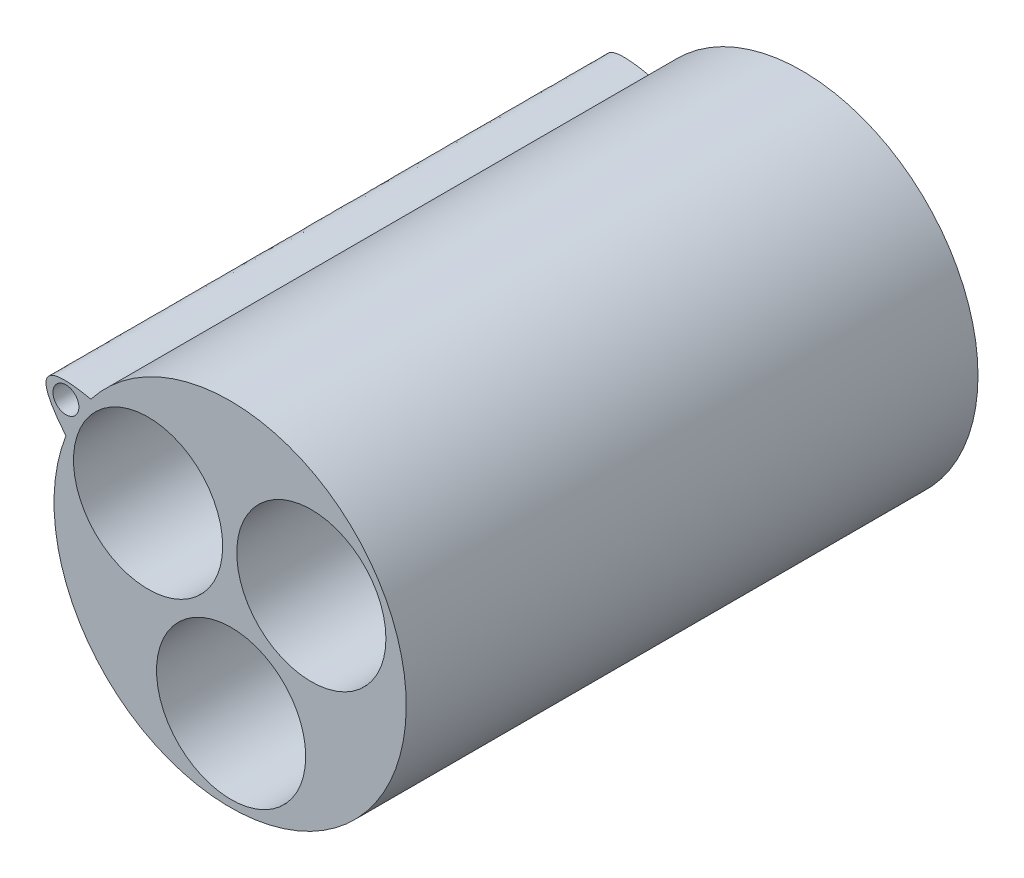
ISO-10303-21;
HEADER;
FILE_DESCRIPTION(('STEP AP214'),'2;1');
FILE_NAME('part.step','',(''),(''),'','','');
FILE_SCHEMA(('AUTOMOTIVE_DESIGN { 1 0 10303 214 1 1 1 1 }'));
ENDSEC;
DATA;
#1=APPLICATION_CONTEXT('core data for automotive mechanical design processes');
#2=APPLICATION_PROTOCOL_DEFINITION('international standard','automotive_design',2000,#1);
#3=PRODUCT_CONTEXT('',#1,'mechanical');
#4=PRODUCT('Part','Part','',(#3));
#5=PRODUCT_RELATED_PRODUCT_CATEGORY('part','',(#4));
#6=PRODUCT_DEFINITION_FORMATION('','',#4);
#7=PRODUCT_DEFINITION_CONTEXT('part definition',#1,'design');
#8=PRODUCT_DEFINITION('design','',#6,#7);
#9=PRODUCT_DEFINITION_SHAPE('','',#8);
#10=(LENGTH_UNIT() NAMED_UNIT(*) SI_UNIT(.MILLI.,.METRE.));
#11=(NAMED_UNIT(*) PLANE_ANGLE_UNIT() SI_UNIT($,.RADIAN.));
#12=(NAMED_UNIT(*) SI_UNIT($,.STERADIAN.) SOLID_ANGLE_UNIT());
#13=UNCERTAINTY_MEASURE_WITH_UNIT(LENGTH_MEASURE(1.E-05),#10,'distance_accuracy_value','');
#14=(GEOMETRIC_REPRESENTATION_CONTEXT(3) GLOBAL_UNCERTAINTY_ASSIGNED_CONTEXT((#13)) GLOBAL_UNIT_ASSIGNED_CONTEXT((#10,
#11,#12)) REPRESENTATION_CONTEXT('',''));
#15=CARTESIAN_POINT('',(0.,0.,0.));
#16=DIRECTION('',(0.,0.,1.));
#17=DIRECTION('',(1.,0.,0.));
#18=AXIS2_PLACEMENT_3D('',#15,#16,#17);
#19=CARTESIAN_POINT('',(0.,0.,70.1));
#20=DIRECTION('',(0.,0.,-1.));
#21=DIRECTION('',(-1.,0.,0.));
#22=AXIS2_PLACEMENT_3D('',#19,#20,#21);
#23=CYLINDRICAL_SURFACE('',#22,21.59);
#24=CARTESIAN_POINT('',(0.,0.,0.));
#25=DIRECTION('',(0.,0.,1.));
#26=DIRECTION('',(1.,0.,0.));
#27=AXIS2_PLACEMENT_3D('',#24,#25,#26);
#28=CIRCLE('',#27,21.59);
#29=CARTESIAN_POINT('',(21.59,0.,0.));
#30=VERTEX_POINT('',#29);
#31=EDGE_CURVE('E38',#30,#30,#28,.T.);
#32=ORIENTED_EDGE('',*,*,#31,.T.);
#33=EDGE_LOOP('',(#32));
#34=FACE_BOUND('',#33,.T.);
#35=DIRECTION('',(0.,0.,1.));
#36=VECTOR('',#35,1.);
#37=CARTESIAN_POINT('',(-20.1343922860048,7.79322444648352,1.51999999999999));
#38=LINE('',#37,#36);
#39=CARTESIAN_POINT('',(-20.1343922860048,7.79322444648352,1.51999999999999));
#40=VERTEX_POINT('',#39);
#41=CARTESIAN_POINT('',(-20.1343922860048,7.79322444648352,70.1));
#42=VERTEX_POINT('',#41);
#43=EDGE_CURVE('E65',#40,#42,#38,.T.);
#44=ORIENTED_EDGE('',*,*,#43,.F.);
#45=CARTESIAN_POINT('',(0.,0.,1.51999999999999));
#46=DIRECTION('',(0.,0.,1.));
#47=DIRECTION('',(1.,0.,0.));
#48=AXIS2_PLACEMENT_3D('',#45,#46,#47);
#49=CIRCLE('',#48,21.59);
#50=CARTESIAN_POINT('',(-17.0753798780908,13.2120968062943,1.51999999999999));
#51=VERTEX_POINT('',#50);
#52=EDGE_CURVE('E70',#51,#40,#49,.T.);
#53=ORIENTED_EDGE('',*,*,#52,.F.);
#54=DIRECTION('',(0.,0.,1.));
#55=VECTOR('',#54,1.);
#56=CARTESIAN_POINT('',(-17.0753798780908,13.2120968062943,1.51999999999999));
#57=LINE('',#56,#55);
#58=CARTESIAN_POINT('',(-17.0753798780908,13.2120968062943,70.1));
#59=VERTEX_POINT('',#58);
#60=EDGE_CURVE('E62',#51,#59,#57,.T.);
#61=ORIENTED_EDGE('',*,*,#60,.T.);
#62=CARTESIAN_POINT('',(0.,0.,70.1));
#63=DIRECTION('',(0.,0.,1.));
#64=DIRECTION('',(1.,0.,0.));
#65=AXIS2_PLACEMENT_3D('',#62,#63,#64);
#66=CIRCLE('',#65,21.59);
#67=EDGE_CURVE('E11',#42,#59,#66,.T.);
#68=ORIENTED_EDGE('',*,*,#67,.F.);
#69=EDGE_LOOP('',(#44,#53,#61,#68));
#70=FACE_BOUND('',#69,.T.);
#71=ADVANCED_FACE('F35',(#34,#70),#23,.T.);
#72=CARTESIAN_POINT('',(0.,0.,70.1));
#73=DIRECTION('',(0.,0.,1.));
#74=DIRECTION('',(1.,0.,0.));
#75=AXIS2_PLACEMENT_3D('',#72,#73,#74);
#76=PLANE('',#75);
#77=CARTESIAN_POINT('',(9.95557947936446,5.86947069419869,70.1));
#78=DIRECTION('',(0.,0.,1.));
#79=DIRECTION('',(1.,0.,0.));
#80=AXIS2_PLACEMENT_3D('',#77,#78,#79);
#81=CIRCLE('',#80,9.144);
#82=CARTESIAN_POINT('',(19.0995794793645,5.86947069419869,70.1));
#83=VERTEX_POINT('',#82);
#84=EDGE_CURVE('E102',#83,#83,#81,.T.);
#85=ORIENTED_EDGE('',*,*,#84,.F.);
#86=EDGE_LOOP('',(#85));
#87=FACE_BOUND('',#86,.T.);
#88=ORIENTED_EDGE('',*,*,#67,.T.);
#89=CARTESIAN_POINT('',(-20.1343922860049,7.79322444648353,70.1));
#90=CARTESIAN_POINT('',(-26.2442995797935,15.2033781561211,70.1));
#91=CARTESIAN_POINT('',(-17.0753798780908,13.2120968062944,70.1));
#92=B_SPLINE_CURVE_WITH_KNOTS('',2,(#89,#90,#91),.UNSPECIFIED.,.F.,.F.,(3,3),(0.,1.),.UNSPECIFIED.);
#93=EDGE_CURVE('E47',#42,#59,#92,.T.);
#94=ORIENTED_EDGE('',*,*,#93,.F.);
#95=EDGE_LOOP('',(#88,#94));
#96=FACE_BOUND('',#95,.T.);
#97=CARTESIAN_POINT('',(0.118855303980422,-11.557,70.1));
#98=DIRECTION('',(0.,0.,1.));
#99=DIRECTION('',(1.,0.,0.));
#100=AXIS2_PLACEMENT_3D('',#97,#98,#99);
#101=CIRCLE('',#100,9.144);
#102=CARTESIAN_POINT('',(9.26285530398042,-11.557,70.1));
#103=VERTEX_POINT('',#102);
#104=EDGE_CURVE('E82',#103,#103,#101,.T.);
#105=ORIENTED_EDGE('',*,*,#104,.F.);
#106=EDGE_LOOP('',(#105));
#107=FACE_BOUND('',#106,.T.);
#108=CARTESIAN_POINT('',(-10.0609004676266,5.68704939142529,70.1));
#109=DIRECTION('',(0.,0.,1.));
#110=DIRECTION('',(1.,0.,0.));
#111=AXIS2_PLACEMENT_3D('',#108,#109,#110);
#112=CIRCLE('',#111,9.144);
#113=CARTESIAN_POINT('',(-0.916900467626609,5.68704939142529,70.1));
#114=VERTEX_POINT('',#113);
#115=EDGE_CURVE('E86',#114,#114,#112,.T.);
#116=ORIENTED_EDGE('',*,*,#115,.F.);
#117=EDGE_LOOP('',(#116));
#118=FACE_BOUND('',#117,.T.);
#119=CARTESIAN_POINT('',(-20.1343922860049,11.6245968062944,70.1));
#120=DIRECTION('',(0.,0.,1.));
#121=DIRECTION('',(1.,0.,0.));
#122=AXIS2_PLACEMENT_3D('',#119,#120,#121);
#123=CIRCLE('',#122,1.5875);
#124=CARTESIAN_POINT('',(-18.5468922860049,11.6245968062944,70.1));
#125=VERTEX_POINT('',#124);
#126=EDGE_CURVE('E67',#125,#125,#123,.T.);
#127=ORIENTED_EDGE('',*,*,#126,.F.);
#128=EDGE_LOOP('',(#127));
#129=FACE_BOUND('',#128,.T.);
#130=ADVANCED_FACE('F73',(#87,#96,#107,#118,#129),#76,.T.);
#131=CARTESIAN_POINT('',(0.,0.,0.));
#132=DIRECTION('',(0.,0.,1.));
#133=DIRECTION('',(1.,0.,0.));
#134=AXIS2_PLACEMENT_3D('',#131,#132,#133);
#135=PLANE('',#134);
#136=ORIENTED_EDGE('',*,*,#31,.F.);
#137=EDGE_LOOP('',(#136));
#138=FACE_BOUND('',#137,.T.);
#139=CARTESIAN_POINT('',(0.118855303980422,-11.557,0.));
#140=DIRECTION('',(0.,0.,1.));
#141=DIRECTION('',(1.,0.,0.));
#142=AXIS2_PLACEMENT_3D('',#139,#140,#141);
#143=CIRCLE('',#142,9.144);
#144=CARTESIAN_POINT('',(9.26285530398042,-11.557,0.));
#145=VERTEX_POINT('',#144);
#146=EDGE_CURVE('E105',#145,#145,#143,.T.);
#147=ORIENTED_EDGE('',*,*,#146,.T.);
#148=EDGE_LOOP('',(#147));
#149=FACE_BOUND('',#148,.T.);
#150=CARTESIAN_POINT('',(9.95557947936446,5.86947069419869,0.));
#151=DIRECTION('',(0.,0.,1.));
#152=DIRECTION('',(1.,0.,0.));
#153=AXIS2_PLACEMENT_3D('',#150,#151,#152);
#154=CIRCLE('',#153,9.144);
#155=CARTESIAN_POINT('',(19.0995794793645,5.86947069419869,0.));
#156=VERTEX_POINT('',#155);
#157=EDGE_CURVE('E99',#156,#156,#154,.T.);
#158=ORIENTED_EDGE('',*,*,#157,.T.);
#159=EDGE_LOOP('',(#158));
#160=FACE_BOUND('',#159,.T.);
#161=CARTESIAN_POINT('',(-10.0609004676266,5.68704939142529,0.));
#162=DIRECTION('',(0.,0.,1.));
#163=DIRECTION('',(1.,0.,0.));
#164=AXIS2_PLACEMENT_3D('',#161,#162,#163);
#165=CIRCLE('',#164,9.144);
#166=CARTESIAN_POINT('',(-0.916900467626609,5.68704939142529,0.));
#167=VERTEX_POINT('',#166);
#168=EDGE_CURVE('E71',#167,#167,#165,.T.);
#169=ORIENTED_EDGE('',*,*,#168,.T.);
#170=EDGE_LOOP('',(#169));
#171=FACE_BOUND('',#170,.T.);
#172=ADVANCED_FACE('F76',(#138,#149,#160,#171),#135,.F.);
#173=CARTESIAN_POINT('',(0.118855303980422,-11.557,70.1));
#174=DIRECTION('',(0.,0.,-1.));
#175=DIRECTION('',(-1.,0.,0.));
#176=AXIS2_PLACEMENT_3D('',#173,#174,#175);
#177=CYLINDRICAL_SURFACE('',#176,9.144);
#178=ORIENTED_EDGE('',*,*,#104,.T.);
#179=EDGE_LOOP('',(#178));
#180=FACE_BOUND('',#179,.T.);
#181=ORIENTED_EDGE('',*,*,#146,.F.);
#182=EDGE_LOOP('',(#181));
#183=FACE_BOUND('',#182,.T.);
#184=ADVANCED_FACE('F114',(#180,#183),#177,.F.);
#185=CARTESIAN_POINT('',(9.95557947936446,5.86947069419869,70.1));
#186=DIRECTION('',(0.,0.,-1.));
#187=DIRECTION('',(-1.,0.,0.));
#188=AXIS2_PLACEMENT_3D('',#185,#186,#187);
#189=CYLINDRICAL_SURFACE('',#188,9.144);
#190=ORIENTED_EDGE('',*,*,#84,.T.);
#191=EDGE_LOOP('',(#190));
#192=FACE_BOUND('',#191,.T.);
#193=ORIENTED_EDGE('',*,*,#157,.F.);
#194=EDGE_LOOP('',(#193));
#195=FACE_BOUND('',#194,.T.);
#196=ADVANCED_FACE('F116',(#192,#195),#189,.F.);
#197=CARTESIAN_POINT('',(-10.0609004676266,5.68704939142529,70.1));
#198=DIRECTION('',(0.,0.,-1.));
#199=DIRECTION('',(-1.,0.,0.));
#200=AXIS2_PLACEMENT_3D('',#197,#198,#199);
#201=CYLINDRICAL_SURFACE('',#200,9.144);
#202=ORIENTED_EDGE('',*,*,#115,.T.);
#203=EDGE_LOOP('',(#202));
#204=FACE_BOUND('',#203,.T.);
#205=ORIENTED_EDGE('',*,*,#168,.F.);
#206=EDGE_LOOP('',(#205));
#207=FACE_BOUND('',#206,.T.);
#208=ADVANCED_FACE('F123',(#204,#207),#201,.F.);
#209=CARTESIAN_POINT('',(-20.1343922860049,7.79322444648353,1.51999999999999));
#210=CARTESIAN_POINT('',(-26.2442995797935,15.2033781561211,1.51999999999999));
#211=CARTESIAN_POINT('',(-17.0753798780908,13.2120968062944,1.51999999999999));
#212=B_SPLINE_CURVE_WITH_KNOTS('',2,(#209,#210,#211),.UNSPECIFIED.,.F.,.F.,(3,3),(0.,1.),.UNSPECIFIED.);
#213=DIRECTION('',(0.,0.,1.));
#214=VECTOR('',#213,1.);
#215=SURFACE_OF_LINEAR_EXTRUSION('',#212,#214);
#216=ORIENTED_EDGE('',*,*,#93,.T.);
#217=ORIENTED_EDGE('',*,*,#60,.F.);
#218=EDGE_CURVE('E55',#40,#51,#212,.T.);
#219=ORIENTED_EDGE('',*,*,#218,.F.);
#220=ORIENTED_EDGE('',*,*,#43,.T.);
#221=EDGE_LOOP('',(#216,#217,#219,#220));
#222=FACE_BOUND('',#221,.T.);
#223=ADVANCED_FACE('F61',(#222),#215,.F.);
#224=CARTESIAN_POINT('',(-20.1343922860049,11.6245968062944,1.51999999999999));
#225=DIRECTION('',(0.,0.,1.));
#226=DIRECTION('',(1.,0.,0.));
#227=AXIS2_PLACEMENT_3D('',#224,#225,#226);
#228=CYLINDRICAL_SURFACE('',#227,1.5875);
#229=CARTESIAN_POINT('',(-20.1343922860049,11.6245968062944,1.51999999999999));
#230=DIRECTION('',(0.,0.,1.));
#231=DIRECTION('',(1.,0.,0.));
#232=AXIS2_PLACEMENT_3D('',#229,#230,#231);
#233=CIRCLE('',#232,1.5875);
#234=CARTESIAN_POINT('',(-18.5468922860049,11.6245968062944,1.51999999999999));
#235=VERTEX_POINT('',#234);
#236=EDGE_CURVE('E97',#235,#235,#233,.T.);
#237=ORIENTED_EDGE('',*,*,#236,.F.);
#238=EDGE_LOOP('',(#237));
#239=FACE_BOUND('',#238,.T.);
#240=ORIENTED_EDGE('',*,*,#126,.T.);
#241=EDGE_LOOP('',(#240));
#242=FACE_BOUND('',#241,.T.);
#243=ADVANCED_FACE('F153',(#239,#242),#228,.F.);
#244=CARTESIAN_POINT('',(0.,0.,1.51999999999999));
#245=DIRECTION('',(0.,0.,1.));
#246=DIRECTION('',(1.,0.,0.));
#247=AXIS2_PLACEMENT_3D('',#244,#245,#246);
#248=PLANE('',#247);
#249=ORIENTED_EDGE('',*,*,#218,.T.);
#250=ORIENTED_EDGE('',*,*,#52,.T.);
#251=EDGE_LOOP('',(#249,#250));
#252=FACE_BOUND('',#251,.T.);
#253=ORIENTED_EDGE('',*,*,#236,.T.);
#254=EDGE_LOOP('',(#253));
#255=FACE_BOUND('',#254,.T.);
#256=ADVANCED_FACE('F162',(#252,#255),#248,.F.);
#257=CLOSED_SHELL('',(#71,#130,#172,#184,#196,#208,#223,#243,#256));
#258=MANIFOLD_SOLID_BREP('B2',#257);
#259=ADVANCED_BREP_SHAPE_REPRESENTATION('',(#18,#258),#14);
#260=SHAPE_DEFINITION_REPRESENTATION(#9,#259);
ENDSEC;
END-ISO-10303-21;
